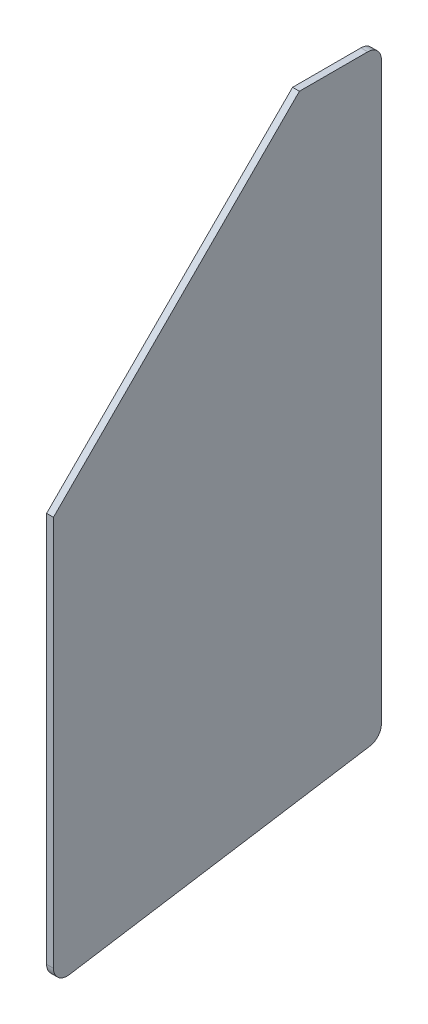
ISO-10303-21;
HEADER;
FILE_DESCRIPTION(('STEP AP214'),'2;1');
FILE_NAME('part.step','',(''),(''),'','','');
FILE_SCHEMA(('AUTOMOTIVE_DESIGN { 1 0 10303 214 1 1 1 1 }'));
ENDSEC;
DATA;
#1=APPLICATION_CONTEXT('core data for automotive mechanical design processes');
#2=APPLICATION_PROTOCOL_DEFINITION('international standard','automotive_design',2000,#1);
#3=PRODUCT_CONTEXT('',#1,'mechanical');
#4=PRODUCT('Part','Part','',(#3));
#5=PRODUCT_RELATED_PRODUCT_CATEGORY('part','',(#4));
#6=PRODUCT_DEFINITION_FORMATION('','',#4);
#7=PRODUCT_DEFINITION_CONTEXT('part definition',#1,'design');
#8=PRODUCT_DEFINITION('design','',#6,#7);
#9=PRODUCT_DEFINITION_SHAPE('','',#8);
#10=(LENGTH_UNIT() NAMED_UNIT(*) SI_UNIT(.MILLI.,.METRE.));
#11=(NAMED_UNIT(*) PLANE_ANGLE_UNIT() SI_UNIT($,.RADIAN.));
#12=(NAMED_UNIT(*) SI_UNIT($,.STERADIAN.) SOLID_ANGLE_UNIT());
#13=UNCERTAINTY_MEASURE_WITH_UNIT(LENGTH_MEASURE(1.E-05),#10,'distance_accuracy_value','');
#14=(GEOMETRIC_REPRESENTATION_CONTEXT(3) GLOBAL_UNCERTAINTY_ASSIGNED_CONTEXT((#13)) GLOBAL_UNIT_ASSIGNED_CONTEXT((#10,
#11,#12)) REPRESENTATION_CONTEXT('',''));
#15=CARTESIAN_POINT('',(0.,0.,0.));
#16=DIRECTION('',(0.,0.,1.));
#17=DIRECTION('',(1.,0.,0.));
#18=AXIS2_PLACEMENT_3D('',#15,#16,#17);
#19=CARTESIAN_POINT('',(0.,0.,0.));
#20=DIRECTION('',(1.,0.,0.));
#21=DIRECTION('',(0.,0.,-1.));
#22=AXIS2_PLACEMENT_3D('',#19,#20,#21);
#23=PLANE('',#22);
#24=CARTESIAN_POINT('',(0.,-122.04504894185,-69.85));
#25=DIRECTION('',(-1.,0.,0.));
#26=DIRECTION('',(0.,0.,1.));
#27=AXIS2_PLACEMENT_3D('',#24,#25,#26);
#28=CIRCLE('',#27,6.35);
#29=CARTESIAN_POINT('',(0.,-128.316869904631,-70.8433588530045));
#30=VERTEX_POINT('',#29);
#31=CARTESIAN_POINT('',(0.,-122.04504894185,-76.2));
#32=VERTEX_POINT('',#31);
#33=EDGE_CURVE('E141',#30,#32,#28,.F.);
#34=ORIENTED_EDGE('',*,*,#33,.F.);
#35=DIRECTION('',(0.,-0.156434465040207,0.987688340595142));
#36=VECTOR('',#35,1.);
#37=CARTESIAN_POINT('',(0.,-127.468461294546,-76.2));
#38=LINE('',#37,#36);
#39=CARTESIAN_POINT('',(0.,-150.443176217967,68.856641146996));
#40=VERTEX_POINT('',#39);
#41=EDGE_CURVE('E126',#30,#40,#38,.T.);
#42=ORIENTED_EDGE('',*,*,#41,.T.);
#43=CARTESIAN_POINT('',(0.,-144.171355255189,69.85));
#44=DIRECTION('',(1.,0.,0.));
#45=DIRECTION('',(0.,0.,-1.));
#46=AXIS2_PLACEMENT_3D('',#43,#44,#45);
#47=CIRCLE('',#46,6.35);
#48=CARTESIAN_POINT('',(0.,-144.171355255189,76.2));
#49=VERTEX_POINT('',#48);
#50=EDGE_CURVE('E19',#49,#40,#47,.T.);
#51=ORIENTED_EDGE('',*,*,#50,.F.);
#52=DIRECTION('',(0.,1.,0.));
#53=VECTOR('',#52,1.);
#54=CARTESIAN_POINT('',(0.,151.60625,76.2));
#55=LINE('',#54,#53);
#56=CARTESIAN_POINT('',(0.,37.30625,76.2));
#57=VERTEX_POINT('',#56);
#58=EDGE_CURVE('E72',#57,#49,#55,.F.);
#59=ORIENTED_EDGE('',*,*,#58,.F.);
#60=DIRECTION('',(0.,0.707106781186548,-0.707106781186548));
#61=VECTOR('',#60,1.);
#62=CARTESIAN_POINT('',(0.,37.30625,76.2));
#63=LINE('',#62,#61);
#64=CARTESIAN_POINT('',(0.,151.60625,-38.1));
#65=VERTEX_POINT('',#64);
#66=EDGE_CURVE('E80',#57,#65,#63,.T.);
#67=ORIENTED_EDGE('',*,*,#66,.T.);
#68=DIRECTION('',(0.,0.,1.));
#69=VECTOR('',#68,1.);
#70=CARTESIAN_POINT('',(0.,151.60625,-76.2));
#71=LINE('',#70,#69);
#72=CARTESIAN_POINT('',(0.,151.60625,-69.85));
#73=VERTEX_POINT('',#72);
#74=EDGE_CURVE('E121',#73,#65,#71,.T.);
#75=ORIENTED_EDGE('',*,*,#74,.F.);
#76=CARTESIAN_POINT('',(0.,145.25625,-69.85));
#77=DIRECTION('',(-1.,0.,0.));
#78=DIRECTION('',(0.,0.,1.));
#79=AXIS2_PLACEMENT_3D('',#76,#77,#78);
#80=CIRCLE('',#79,6.35);
#81=CARTESIAN_POINT('',(0.,145.25625,-76.2));
#82=VERTEX_POINT('',#81);
#83=EDGE_CURVE('E107',#82,#73,#80,.F.);
#84=ORIENTED_EDGE('',*,*,#83,.F.);
#85=DIRECTION('',(0.,1.,0.));
#86=VECTOR('',#85,1.);
#87=CARTESIAN_POINT('',(0.,-151.60625,-76.2));
#88=LINE('',#87,#86);
#89=EDGE_CURVE('E117',#32,#82,#88,.T.);
#90=ORIENTED_EDGE('',*,*,#89,.F.);
#91=EDGE_LOOP('',(#34,#42,#51,#59,#67,#75,#84,#90));
#92=FACE_BOUND('',#91,.T.);
#93=ADVANCED_FACE('F16',(#92),#23,.F.);
#94=CARTESIAN_POINT('',(0.,151.60625,-76.2));
#95=DIRECTION('',(0.,1.,0.));
#96=DIRECTION('',(0.,0.,1.));
#97=AXIS2_PLACEMENT_3D('',#94,#95,#96);
#98=PLANE('',#97);
#99=DIRECTION('',(0.,0.,-1.));
#100=VECTOR('',#99,1.);
#101=CARTESIAN_POINT('',(3.175,151.60625,0.));
#102=LINE('',#101,#100);
#103=CARTESIAN_POINT('',(3.175,151.60625,-69.85));
#104=VERTEX_POINT('',#103);
#105=CARTESIAN_POINT('',(3.175,151.60625,-38.1));
#106=VERTEX_POINT('',#105);
#107=EDGE_CURVE('E105',#104,#106,#102,.F.);
#108=ORIENTED_EDGE('',*,*,#107,.F.);
#109=DIRECTION('',(-1.,0.,0.));
#110=VECTOR('',#109,1.);
#111=CARTESIAN_POINT('',(11.13155,151.60625,-69.85));
#112=LINE('',#111,#110);
#113=EDGE_CURVE('E119',#73,#104,#112,.F.);
#114=ORIENTED_EDGE('',*,*,#113,.F.);
#115=ORIENTED_EDGE('',*,*,#74,.T.);
#116=DIRECTION('',(1.,0.,0.));
#117=VECTOR('',#116,1.);
#118=CARTESIAN_POINT('',(3.175,151.60625,-38.1));
#119=LINE('',#118,#117);
#120=EDGE_CURVE('E91',#65,#106,#119,.T.);
#121=ORIENTED_EDGE('',*,*,#120,.T.);
#122=EDGE_LOOP('',(#108,#114,#115,#121));
#123=FACE_BOUND('',#122,.T.);
#124=ADVANCED_FACE('F238',(#123),#98,.T.);
#125=CARTESIAN_POINT('',(3.175,37.30625,76.2));
#126=DIRECTION('',(0.,-0.707106781186548,-0.707106781186548));
#127=DIRECTION('',(0.,0.707106781186548,-0.707106781186548));
#128=AXIS2_PLACEMENT_3D('',#125,#126,#127);
#129=PLANE('',#128);
#130=DIRECTION('',(0.,-0.707106781186548,0.707106781186547));
#131=VECTOR('',#130,1.);
#132=CARTESIAN_POINT('',(3.175,151.60625,-38.1));
#133=LINE('',#132,#131);
#134=CARTESIAN_POINT('',(3.175,37.30625,76.2));
#135=VERTEX_POINT('',#134);
#136=EDGE_CURVE('E89',#106,#135,#133,.T.);
#137=ORIENTED_EDGE('',*,*,#136,.F.);
#138=ORIENTED_EDGE('',*,*,#120,.F.);
#139=ORIENTED_EDGE('',*,*,#66,.F.);
#140=DIRECTION('',(1.,0.,0.));
#141=VECTOR('',#140,1.);
#142=CARTESIAN_POINT('',(0.,37.30625,76.2));
#143=LINE('',#142,#141);
#144=EDGE_CURVE('E85',#135,#57,#143,.F.);
#145=ORIENTED_EDGE('',*,*,#144,.F.);
#146=EDGE_LOOP('',(#137,#138,#139,#145));
#147=FACE_BOUND('',#146,.T.);
#148=ADVANCED_FACE('F87',(#147),#129,.F.);
#149=CARTESIAN_POINT('',(0.,151.60625,76.2));
#150=DIRECTION('',(0.,0.,1.));
#151=DIRECTION('',(1.,0.,0.));
#152=AXIS2_PLACEMENT_3D('',#149,#150,#151);
#153=PLANE('',#152);
#154=ORIENTED_EDGE('',*,*,#58,.T.);
#155=DIRECTION('',(1.,0.,0.));
#156=VECTOR('',#155,1.);
#157=CARTESIAN_POINT('',(-7.95655,-144.171355255189,76.2));
#158=LINE('',#157,#156);
#159=CARTESIAN_POINT('',(3.175,-144.171355255189,76.2));
#160=VERTEX_POINT('',#159);
#161=EDGE_CURVE('E97',#160,#49,#158,.F.);
#162=ORIENTED_EDGE('',*,*,#161,.F.);
#163=DIRECTION('',(0.,1.,0.));
#164=VECTOR('',#163,1.);
#165=CARTESIAN_POINT('',(3.175,0.,76.2));
#166=LINE('',#165,#164);
#167=EDGE_CURVE('E94',#135,#160,#166,.F.);
#168=ORIENTED_EDGE('',*,*,#167,.F.);
#169=ORIENTED_EDGE('',*,*,#144,.T.);
#170=EDGE_LOOP('',(#154,#162,#168,#169));
#171=FACE_BOUND('',#170,.T.);
#172=ADVANCED_FACE('F95',(#171),#153,.T.);
#173=CARTESIAN_POINT('',(-7.95655,-144.171355255189,69.85));
#174=DIRECTION('',(1.,0.,0.));
#175=DIRECTION('',(0.,0.,-1.));
#176=AXIS2_PLACEMENT_3D('',#173,#174,#175);
#177=CYLINDRICAL_SURFACE('',#176,6.35);
#178=DIRECTION('',(1.,0.,0.));
#179=VECTOR('',#178,1.);
#180=CARTESIAN_POINT('',(3.175,-150.443176217967,68.8566411469971));
#181=LINE('',#180,#179);
#182=CARTESIAN_POINT('',(3.175,-150.44317621797,68.8566411469954));
#183=VERTEX_POINT('',#182);
#184=EDGE_CURVE('E128',#40,#183,#181,.T.);
#185=ORIENTED_EDGE('',*,*,#184,.T.);
#186=CARTESIAN_POINT('',(3.175,-144.171355255189,69.85));
#187=DIRECTION('',(1.,0.,0.));
#188=DIRECTION('',(0.,0.,-1.));
#189=AXIS2_PLACEMENT_3D('',#186,#187,#188);
#190=CIRCLE('',#189,6.35);
#191=EDGE_CURVE('E101',#160,#183,#190,.T.);
#192=ORIENTED_EDGE('',*,*,#191,.F.);
#193=ORIENTED_EDGE('',*,*,#161,.T.);
#194=ORIENTED_EDGE('',*,*,#50,.T.);
#195=EDGE_LOOP('',(#185,#192,#193,#194));
#196=FACE_BOUND('',#195,.T.);
#197=ADVANCED_FACE('F157',(#196),#177,.T.);
#198=CARTESIAN_POINT('',(3.175,-127.468461294546,-76.2));
#199=DIRECTION('',(0.,0.987688340595142,0.156434465040207));
#200=DIRECTION('',(0.,-0.156434465040207,0.987688340595142));
#201=AXIS2_PLACEMENT_3D('',#198,#199,#200);
#202=PLANE('',#201);
#203=ORIENTED_EDGE('',*,*,#184,.F.);
#204=ORIENTED_EDGE('',*,*,#41,.F.);
#205=DIRECTION('',(-1.,0.,0.));
#206=VECTOR('',#205,1.);
#207=CARTESIAN_POINT('',(11.13155,-128.316869904629,-70.8433588530032));
#208=LINE('',#207,#206);
#209=CARTESIAN_POINT('',(3.175,-128.316869904632,-70.8433588530047));
#210=VERTEX_POINT('',#209);
#211=EDGE_CURVE('E142',#210,#30,#208,.T.);
#212=ORIENTED_EDGE('',*,*,#211,.F.);
#213=DIRECTION('',(0.,0.15643446504024,-0.987688340595136));
#214=VECTOR('',#213,1.);
#215=CARTESIAN_POINT('',(3.175,-150.443176217973,68.856641146996));
#216=LINE('',#215,#214);
#217=EDGE_CURVE('E138',#183,#210,#216,.T.);
#218=ORIENTED_EDGE('',*,*,#217,.F.);
#219=EDGE_LOOP('',(#203,#204,#212,#218));
#220=FACE_BOUND('',#219,.T.);
#221=ADVANCED_FACE('F161',(#220),#202,.F.);
#222=CARTESIAN_POINT('',(11.13155,-122.04504894185,-69.85));
#223=DIRECTION('',(-1.,0.,0.));
#224=DIRECTION('',(0.,0.,1.));
#225=AXIS2_PLACEMENT_3D('',#222,#223,#224);
#226=CYLINDRICAL_SURFACE('',#225,6.35);
#227=ORIENTED_EDGE('',*,*,#211,.T.);
#228=ORIENTED_EDGE('',*,*,#33,.T.);
#229=DIRECTION('',(-1.,0.,0.));
#230=VECTOR('',#229,1.);
#231=CARTESIAN_POINT('',(0.,-122.04504894185,-76.2));
#232=LINE('',#231,#230);
#233=CARTESIAN_POINT('',(3.175,-122.04504894185,-76.2));
#234=VERTEX_POINT('',#233);
#235=EDGE_CURVE('E120',#234,#32,#232,.T.);
#236=ORIENTED_EDGE('',*,*,#235,.F.);
#237=CARTESIAN_POINT('',(3.175,-122.04504894185,-69.85));
#238=DIRECTION('',(-1.,0.,0.));
#239=DIRECTION('',(0.,0.,1.));
#240=AXIS2_PLACEMENT_3D('',#237,#238,#239);
#241=CIRCLE('',#240,6.35);
#242=EDGE_CURVE('E135',#210,#234,#241,.F.);
#243=ORIENTED_EDGE('',*,*,#242,.F.);
#244=EDGE_LOOP('',(#227,#228,#236,#243));
#245=FACE_BOUND('',#244,.T.);
#246=ADVANCED_FACE('F176',(#245),#226,.T.);
#247=CARTESIAN_POINT('',(0.,-151.60625,-76.2));
#248=DIRECTION('',(0.,0.,-1.));
#249=DIRECTION('',(-1.,0.,0.));
#250=AXIS2_PLACEMENT_3D('',#247,#248,#249);
#251=PLANE('',#250);
#252=ORIENTED_EDGE('',*,*,#89,.T.);
#253=DIRECTION('',(-1.,0.,0.));
#254=VECTOR('',#253,1.);
#255=CARTESIAN_POINT('',(11.13155,145.25625,-76.2));
#256=LINE('',#255,#254);
#257=CARTESIAN_POINT('',(3.175,145.25625,-76.2));
#258=VERTEX_POINT('',#257);
#259=EDGE_CURVE('E34',#258,#82,#256,.T.);
#260=ORIENTED_EDGE('',*,*,#259,.F.);
#261=DIRECTION('',(0.,1.,0.));
#262=VECTOR('',#261,1.);
#263=CARTESIAN_POINT('',(3.175,0.,-76.2));
#264=LINE('',#263,#262);
#265=EDGE_CURVE('E25',#234,#258,#264,.T.);
#266=ORIENTED_EDGE('',*,*,#265,.F.);
#267=ORIENTED_EDGE('',*,*,#235,.T.);
#268=EDGE_LOOP('',(#252,#260,#266,#267));
#269=FACE_BOUND('',#268,.T.);
#270=ADVANCED_FACE('F175',(#269),#251,.T.);
#271=CARTESIAN_POINT('',(11.13155,145.25625,-69.85));
#272=DIRECTION('',(-1.,0.,0.));
#273=DIRECTION('',(0.,0.,1.));
#274=AXIS2_PLACEMENT_3D('',#271,#272,#273);
#275=CYLINDRICAL_SURFACE('',#274,6.35);
#276=ORIENTED_EDGE('',*,*,#259,.T.);
#277=ORIENTED_EDGE('',*,*,#83,.T.);
#278=ORIENTED_EDGE('',*,*,#113,.T.);
#279=CARTESIAN_POINT('',(3.175,145.25625,-69.85));
#280=DIRECTION('',(-1.,0.,0.));
#281=DIRECTION('',(0.,0.,1.));
#282=AXIS2_PLACEMENT_3D('',#279,#280,#281);
#283=CIRCLE('',#282,6.35);
#284=EDGE_CURVE('E11',#258,#104,#283,.F.);
#285=ORIENTED_EDGE('',*,*,#284,.F.);
#286=EDGE_LOOP('',(#276,#277,#278,#285));
#287=FACE_BOUND('',#286,.T.);
#288=ADVANCED_FACE('F172',(#287),#275,.T.);
#289=CARTESIAN_POINT('',(3.175,0.,0.));
#290=DIRECTION('',(1.,0.,0.));
#291=DIRECTION('',(0.,0.,-1.));
#292=AXIS2_PLACEMENT_3D('',#289,#290,#291);
#293=PLANE('',#292);
#294=ORIENTED_EDGE('',*,*,#265,.T.);
#295=ORIENTED_EDGE('',*,*,#284,.T.);
#296=ORIENTED_EDGE('',*,*,#107,.T.);
#297=ORIENTED_EDGE('',*,*,#136,.T.);
#298=ORIENTED_EDGE('',*,*,#167,.T.);
#299=ORIENTED_EDGE('',*,*,#191,.T.);
#300=ORIENTED_EDGE('',*,*,#217,.T.);
#301=ORIENTED_EDGE('',*,*,#242,.T.);
#302=EDGE_LOOP('',(#294,#295,#296,#297,#298,#299,#300,#301));
#303=FACE_BOUND('',#302,.T.);
#304=ADVANCED_FACE('F104',(#303),#293,.T.);
#305=CLOSED_SHELL('',(#93,#124,#148,#172,#197,#221,#246,#270,#288,#304));
#306=MANIFOLD_SOLID_BREP('B1',#305);
#307=ADVANCED_BREP_SHAPE_REPRESENTATION('',(#18,#306),#14);
#308=SHAPE_DEFINITION_REPRESENTATION(#9,#307);
ENDSEC;
END-ISO-10303-21;
